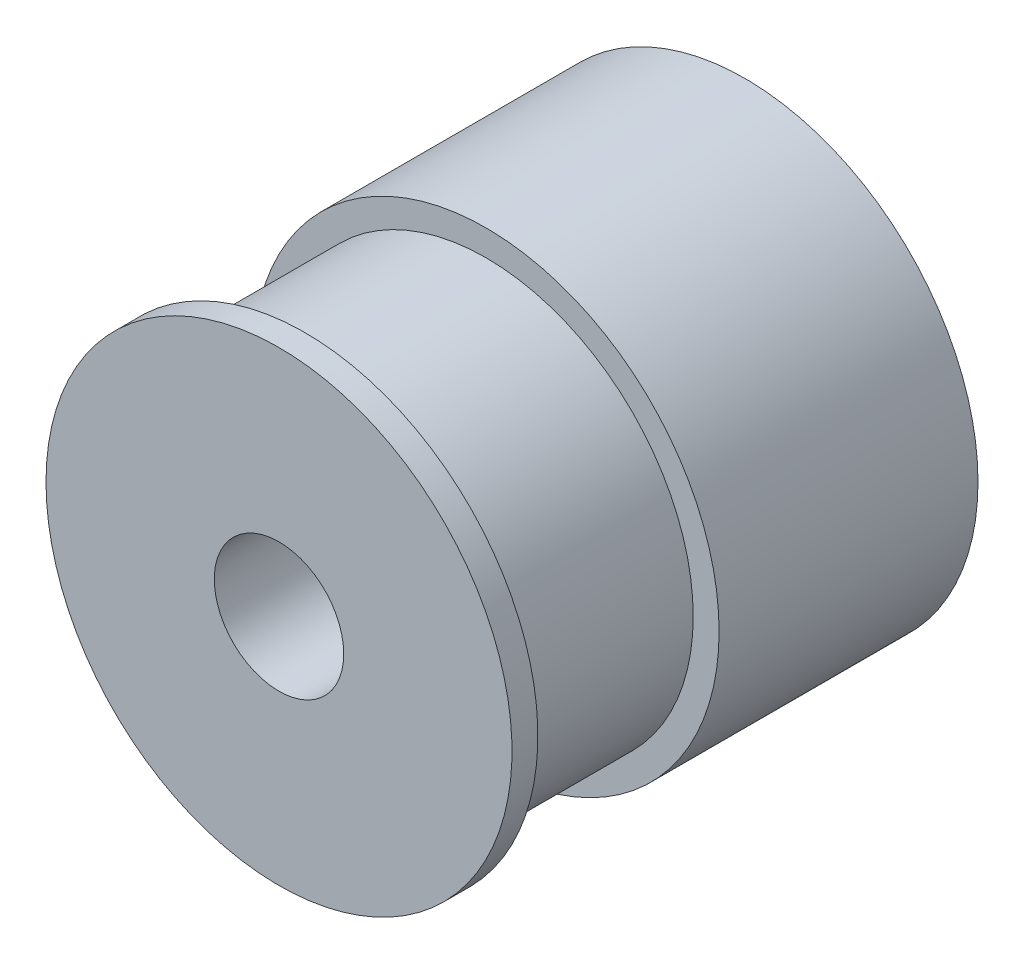
ISO-10303-21;
HEADER;
FILE_DESCRIPTION(('STEP AP214'),'2;1');
FILE_NAME('part.step','',(''),(''),'','','');
FILE_SCHEMA(('AUTOMOTIVE_DESIGN { 1 0 10303 214 1 1 1 1 }'));
ENDSEC;
DATA;
#1=APPLICATION_CONTEXT('core data for automotive mechanical design processes');
#2=APPLICATION_PROTOCOL_DEFINITION('international standard','automotive_design',2000,#1);
#3=PRODUCT_CONTEXT('',#1,'mechanical');
#4=PRODUCT('Part','Part','',(#3));
#5=PRODUCT_RELATED_PRODUCT_CATEGORY('part','',(#4));
#6=PRODUCT_DEFINITION_FORMATION('','',#4);
#7=PRODUCT_DEFINITION_CONTEXT('part definition',#1,'design');
#8=PRODUCT_DEFINITION('design','',#6,#7);
#9=PRODUCT_DEFINITION_SHAPE('','',#8);
#10=(LENGTH_UNIT() NAMED_UNIT(*) SI_UNIT(.MILLI.,.METRE.));
#11=(NAMED_UNIT(*) PLANE_ANGLE_UNIT() SI_UNIT($,.RADIAN.));
#12=(NAMED_UNIT(*) SI_UNIT($,.STERADIAN.) SOLID_ANGLE_UNIT());
#13=UNCERTAINTY_MEASURE_WITH_UNIT(LENGTH_MEASURE(1.E-05),#10,'distance_accuracy_value','');
#14=(GEOMETRIC_REPRESENTATION_CONTEXT(3) GLOBAL_UNCERTAINTY_ASSIGNED_CONTEXT((#13)) GLOBAL_UNIT_ASSIGNED_CONTEXT((#10,
#11,#12)) REPRESENTATION_CONTEXT('',''));
#15=CARTESIAN_POINT('',(0.,0.,0.));
#16=DIRECTION('',(0.,0.,1.));
#17=DIRECTION('',(1.,0.,0.));
#18=AXIS2_PLACEMENT_3D('',#15,#16,#17);
#19=CARTESIAN_POINT('',(0.,0.,18.));
#20=DIRECTION('',(0.,0.,-1.));
#21=DIRECTION('',(-1.,0.,0.));
#22=AXIS2_PLACEMENT_3D('',#19,#20,#21);
#23=CYLINDRICAL_SURFACE('',#22,9.);
#24=CARTESIAN_POINT('',(0.,0.,18.));
#25=DIRECTION('',(0.,0.,-1.));
#26=DIRECTION('',(-1.,0.,0.));
#27=AXIS2_PLACEMENT_3D('',#24,#25,#26);
#28=CIRCLE('',#27,9.);
#29=CARTESIAN_POINT('',(-9.,0.,18.));
#30=VERTEX_POINT('',#29);
#31=EDGE_CURVE('E40',#30,#30,#28,.F.);
#32=ORIENTED_EDGE('',*,*,#31,.F.);
#33=EDGE_LOOP('',(#32));
#34=FACE_BOUND('',#33,.T.);
#35=CARTESIAN_POINT('',(0.,0.,17.));
#36=DIRECTION('',(0.,0.,-1.));
#37=DIRECTION('',(-1.,0.,0.));
#38=AXIS2_PLACEMENT_3D('',#35,#36,#37);
#39=CIRCLE('',#38,9.);
#40=CARTESIAN_POINT('',(-9.,0.,17.));
#41=VERTEX_POINT('',#40);
#42=EDGE_CURVE('E18',#41,#41,#39,.F.);
#43=ORIENTED_EDGE('',*,*,#42,.T.);
#44=EDGE_LOOP('',(#43));
#45=FACE_BOUND('',#44,.T.);
#46=ADVANCED_FACE('F15',(#34,#45),#23,.T.);
#47=CARTESIAN_POINT('',(0.,0.,17.));
#48=DIRECTION('',(0.,0.,1.));
#49=DIRECTION('',(1.,0.,0.));
#50=AXIS2_PLACEMENT_3D('',#47,#48,#49);
#51=PLANE('',#50);
#52=CARTESIAN_POINT('',(0.,0.,17.));
#53=DIRECTION('',(0.,0.,1.));
#54=DIRECTION('',(1.,0.,0.));
#55=AXIS2_PLACEMENT_3D('',#52,#53,#54);
#56=CIRCLE('',#55,8.);
#57=CARTESIAN_POINT('',(8.,0.,17.));
#58=VERTEX_POINT('',#57);
#59=EDGE_CURVE('E38',#58,#58,#56,.F.);
#60=ORIENTED_EDGE('',*,*,#59,.F.);
#61=EDGE_LOOP('',(#60));
#62=FACE_BOUND('',#61,.T.);
#63=ORIENTED_EDGE('',*,*,#42,.F.);
#64=EDGE_LOOP('',(#63));
#65=FACE_BOUND('',#64,.T.);
#66=ADVANCED_FACE('F48',(#62,#65),#51,.F.);
#67=CARTESIAN_POINT('',(0.,0.,18.));
#68=DIRECTION('',(0.,0.,1.));
#69=DIRECTION('',(1.,0.,0.));
#70=AXIS2_PLACEMENT_3D('',#67,#68,#69);
#71=PLANE('',#70);
#72=CARTESIAN_POINT('',(0.,0.,18.));
#73=DIRECTION('',(0.,0.,1.));
#74=DIRECTION('',(1.,0.,0.));
#75=AXIS2_PLACEMENT_3D('',#72,#73,#74);
#76=CIRCLE('',#75,2.5);
#77=CARTESIAN_POINT('',(2.5,0.,18.));
#78=VERTEX_POINT('',#77);
#79=EDGE_CURVE('E35',#78,#78,#76,.F.);
#80=ORIENTED_EDGE('',*,*,#79,.T.);
#81=EDGE_LOOP('',(#80));
#82=FACE_BOUND('',#81,.T.);
#83=ORIENTED_EDGE('',*,*,#31,.T.);
#84=EDGE_LOOP('',(#83));
#85=FACE_BOUND('',#84,.T.);
#86=ADVANCED_FACE('F50',(#82,#85),#71,.T.);
#87=CARTESIAN_POINT('',(0.,0.,0.));
#88=DIRECTION('',(0.,0.,1.));
#89=DIRECTION('',(1.,0.,0.));
#90=AXIS2_PLACEMENT_3D('',#87,#88,#89);
#91=CYLINDRICAL_SURFACE('',#90,8.);
#92=CARTESIAN_POINT('',(0.,0.,10.));
#93=DIRECTION('',(0.,0.,1.));
#94=DIRECTION('',(1.,0.,0.));
#95=AXIS2_PLACEMENT_3D('',#92,#93,#94);
#96=CIRCLE('',#95,8.);
#97=CARTESIAN_POINT('',(8.,0.,10.));
#98=VERTEX_POINT('',#97);
#99=EDGE_CURVE('E32',#98,#98,#96,.F.);
#100=ORIENTED_EDGE('',*,*,#99,.F.);
#101=EDGE_LOOP('',(#100));
#102=FACE_BOUND('',#101,.T.);
#103=ORIENTED_EDGE('',*,*,#59,.T.);
#104=EDGE_LOOP('',(#103));
#105=FACE_BOUND('',#104,.T.);
#106=ADVANCED_FACE('F57',(#102,#105),#91,.T.);
#107=CARTESIAN_POINT('',(0.,0.,0.));
#108=DIRECTION('',(0.,0.,1.));
#109=DIRECTION('',(1.,0.,0.));
#110=AXIS2_PLACEMENT_3D('',#107,#108,#109);
#111=CYLINDRICAL_SURFACE('',#110,2.5);
#112=CARTESIAN_POINT('',(0.,0.,0.));
#113=DIRECTION('',(0.,0.,1.));
#114=DIRECTION('',(1.,0.,0.));
#115=AXIS2_PLACEMENT_3D('',#112,#113,#114);
#116=CIRCLE('',#115,2.5);
#117=CARTESIAN_POINT('',(2.5,0.,0.));
#118=VERTEX_POINT('',#117);
#119=EDGE_CURVE('E27',#118,#118,#116,.F.);
#120=ORIENTED_EDGE('',*,*,#119,.T.);
#121=EDGE_LOOP('',(#120));
#122=FACE_BOUND('',#121,.T.);
#123=ORIENTED_EDGE('',*,*,#79,.F.);
#124=EDGE_LOOP('',(#123));
#125=FACE_BOUND('',#124,.T.);
#126=ADVANCED_FACE('F76',(#122,#125),#111,.F.);
#127=CARTESIAN_POINT('',(0.,0.,10.));
#128=DIRECTION('',(0.,0.,1.));
#129=DIRECTION('',(1.,0.,0.));
#130=AXIS2_PLACEMENT_3D('',#127,#128,#129);
#131=PLANE('',#130);
#132=ORIENTED_EDGE('',*,*,#99,.T.);
#133=EDGE_LOOP('',(#132));
#134=FACE_BOUND('',#133,.T.);
#135=CARTESIAN_POINT('',(0.,0.,10.));
#136=DIRECTION('',(0.,0.,1.));
#137=DIRECTION('',(1.,0.,0.));
#138=AXIS2_PLACEMENT_3D('',#135,#136,#137);
#139=CIRCLE('',#138,9.);
#140=CARTESIAN_POINT('',(9.,0.,10.));
#141=VERTEX_POINT('',#140);
#142=EDGE_CURVE('E22',#141,#141,#139,.F.);
#143=ORIENTED_EDGE('',*,*,#142,.F.);
#144=EDGE_LOOP('',(#143));
#145=FACE_BOUND('',#144,.T.);
#146=ADVANCED_FACE('F69',(#134,#145),#131,.T.);
#147=CARTESIAN_POINT('',(0.,0.,0.));
#148=DIRECTION('',(0.,0.,1.));
#149=DIRECTION('',(1.,0.,0.));
#150=AXIS2_PLACEMENT_3D('',#147,#148,#149);
#151=PLANE('',#150);
#152=ORIENTED_EDGE('',*,*,#119,.F.);
#153=EDGE_LOOP('',(#152));
#154=FACE_BOUND('',#153,.T.);
#155=CARTESIAN_POINT('',(0.,0.,0.));
#156=DIRECTION('',(0.,0.,1.));
#157=DIRECTION('',(1.,0.,0.));
#158=AXIS2_PLACEMENT_3D('',#155,#156,#157);
#159=CIRCLE('',#158,9.);
#160=CARTESIAN_POINT('',(9.,0.,0.));
#161=VERTEX_POINT('',#160);
#162=EDGE_CURVE('E10',#161,#161,#159,.T.);
#163=ORIENTED_EDGE('',*,*,#162,.F.);
#164=EDGE_LOOP('',(#163));
#165=FACE_BOUND('',#164,.T.);
#166=ADVANCED_FACE('F64',(#154,#165),#151,.F.);
#167=CARTESIAN_POINT('',(0.,0.,0.));
#168=DIRECTION('',(0.,0.,1.));
#169=DIRECTION('',(1.,0.,0.));
#170=AXIS2_PLACEMENT_3D('',#167,#168,#169);
#171=CYLINDRICAL_SURFACE('',#170,9.);
#172=ORIENTED_EDGE('',*,*,#162,.T.);
#173=EDGE_LOOP('',(#172));
#174=FACE_BOUND('',#173,.T.);
#175=ORIENTED_EDGE('',*,*,#142,.T.);
#176=EDGE_LOOP('',(#175));
#177=FACE_BOUND('',#176,.T.);
#178=ADVANCED_FACE('F62',(#174,#177),#171,.T.);
#179=CLOSED_SHELL('',(#46,#66,#86,#106,#126,#146,#166,#178));
#180=MANIFOLD_SOLID_BREP('B1',#179);
#181=ADVANCED_BREP_SHAPE_REPRESENTATION('',(#18,#180),#14);
#182=SHAPE_DEFINITION_REPRESENTATION(#9,#181);
ENDSEC;
END-ISO-10303-21;
